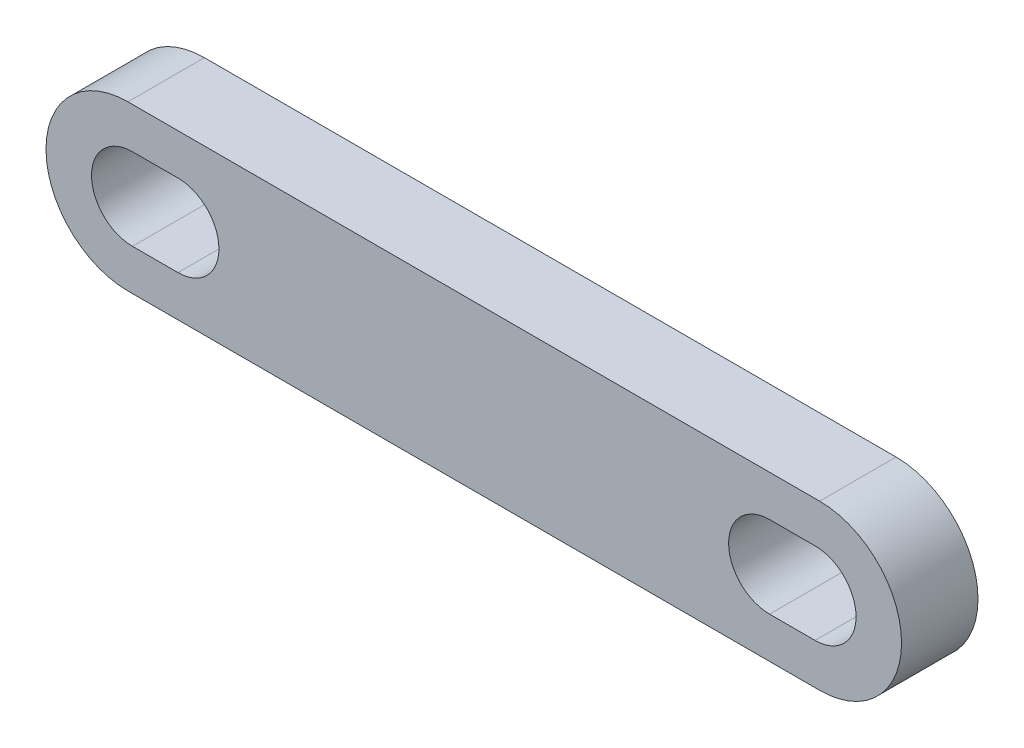
ISO-10303-21;
HEADER;
FILE_DESCRIPTION(('STEP AP214'),'2;1');
FILE_NAME('part.step','',(''),(''),'','','');
FILE_SCHEMA(('AUTOMOTIVE_DESIGN { 1 0 10303 214 1 1 1 1 }'));
ENDSEC;
DATA;
#1=APPLICATION_CONTEXT('core data for automotive mechanical design processes');
#2=APPLICATION_PROTOCOL_DEFINITION('international standard','automotive_design',2000,#1);
#3=PRODUCT_CONTEXT('',#1,'mechanical');
#4=PRODUCT('Part','Part','',(#3));
#5=PRODUCT_RELATED_PRODUCT_CATEGORY('part','',(#4));
#6=PRODUCT_DEFINITION_FORMATION('','',#4);
#7=PRODUCT_DEFINITION_CONTEXT('part definition',#1,'design');
#8=PRODUCT_DEFINITION('design','',#6,#7);
#9=PRODUCT_DEFINITION_SHAPE('','',#8);
#10=(LENGTH_UNIT() NAMED_UNIT(*) SI_UNIT(.MILLI.,.METRE.));
#11=(NAMED_UNIT(*) PLANE_ANGLE_UNIT() SI_UNIT($,.RADIAN.));
#12=(NAMED_UNIT(*) SI_UNIT($,.STERADIAN.) SOLID_ANGLE_UNIT());
#13=UNCERTAINTY_MEASURE_WITH_UNIT(LENGTH_MEASURE(1.E-05),#10,'distance_accuracy_value','');
#14=(GEOMETRIC_REPRESENTATION_CONTEXT(3) GLOBAL_UNCERTAINTY_ASSIGNED_CONTEXT((#13)) GLOBAL_UNIT_ASSIGNED_CONTEXT((#10,
#11,#12)) REPRESENTATION_CONTEXT('',''));
#15=CARTESIAN_POINT('',(0.,0.,0.));
#16=DIRECTION('',(0.,0.,1.));
#17=DIRECTION('',(1.,0.,0.));
#18=AXIS2_PLACEMENT_3D('',#15,#16,#17);
#19=CARTESIAN_POINT('',(19.,0.,4.2));
#20=DIRECTION('',(0.,0.,1.));
#21=DIRECTION('',(1.,0.,0.));
#22=AXIS2_PLACEMENT_3D('',#19,#20,#21);
#23=PLANE('',#22);
#24=CARTESIAN_POINT('',(19.,0.,4.2));
#25=DIRECTION('',(0.,0.,1.));
#26=DIRECTION('',(1.,0.,0.));
#27=AXIS2_PLACEMENT_3D('',#24,#25,#26);
#28=CIRCLE('',#27,4.5);
#29=CARTESIAN_POINT('',(19.,-4.5,4.2));
#30=VERTEX_POINT('',#29);
#31=CARTESIAN_POINT('',(19.,4.5,4.2));
#32=VERTEX_POINT('',#31);
#33=EDGE_CURVE('E190',#30,#32,#28,.T.);
#34=ORIENTED_EDGE('',*,*,#33,.T.);
#35=DIRECTION('',(-1.,0.,0.));
#36=VECTOR('',#35,1.);
#37=CARTESIAN_POINT('',(19.,4.5,4.2));
#38=LINE('',#37,#36);
#39=CARTESIAN_POINT('',(-19.,4.5,4.2));
#40=VERTEX_POINT('',#39);
#41=EDGE_CURVE('E193',#32,#40,#38,.T.);
#42=ORIENTED_EDGE('',*,*,#41,.T.);
#43=CARTESIAN_POINT('',(-19.,0.,4.2));
#44=DIRECTION('',(0.,0.,1.));
#45=DIRECTION('',(1.,0.,0.));
#46=AXIS2_PLACEMENT_3D('',#43,#44,#45);
#47=CIRCLE('',#46,4.5);
#48=CARTESIAN_POINT('',(-19.,-4.5,4.2));
#49=VERTEX_POINT('',#48);
#50=EDGE_CURVE('E196',#40,#49,#47,.T.);
#51=ORIENTED_EDGE('',*,*,#50,.T.);
#52=DIRECTION('',(1.,0.,0.));
#53=VECTOR('',#52,1.);
#54=CARTESIAN_POINT('',(-19.,-4.5,4.2));
#55=LINE('',#54,#53);
#56=EDGE_CURVE('E198',#49,#30,#55,.T.);
#57=ORIENTED_EDGE('',*,*,#56,.T.);
#58=EDGE_LOOP('',(#34,#42,#51,#57));
#59=FACE_BOUND('',#58,.T.);
#60=DIRECTION('',(1.,0.,0.));
#61=VECTOR('',#60,1.);
#62=CARTESIAN_POINT('',(16.25,-2.25,4.2));
#63=LINE('',#62,#61);
#64=CARTESIAN_POINT('',(16.25,-2.25,4.2));
#65=VERTEX_POINT('',#64);
#66=CARTESIAN_POINT('',(18.75,-2.25,4.2));
#67=VERTEX_POINT('',#66);
#68=EDGE_CURVE('E161',#65,#67,#63,.T.);
#69=ORIENTED_EDGE('',*,*,#68,.F.);
#70=CARTESIAN_POINT('',(16.25,0.,4.2));
#71=DIRECTION('',(0.,0.,1.));
#72=DIRECTION('',(1.,0.,0.));
#73=AXIS2_PLACEMENT_3D('',#70,#71,#72);
#74=CIRCLE('',#73,2.25);
#75=CARTESIAN_POINT('',(16.25,2.25,4.2));
#76=VERTEX_POINT('',#75);
#77=EDGE_CURVE('E159',#76,#65,#74,.T.);
#78=ORIENTED_EDGE('',*,*,#77,.F.);
#79=DIRECTION('',(-1.,0.,0.));
#80=VECTOR('',#79,1.);
#81=CARTESIAN_POINT('',(18.75,2.25,4.2));
#82=LINE('',#81,#80);
#83=CARTESIAN_POINT('',(18.75,2.25,4.2));
#84=VERTEX_POINT('',#83);
#85=EDGE_CURVE('E167',#84,#76,#82,.T.);
#86=ORIENTED_EDGE('',*,*,#85,.F.);
#87=CARTESIAN_POINT('',(18.75,0.,4.2));
#88=DIRECTION('',(0.,0.,1.));
#89=DIRECTION('',(1.,0.,0.));
#90=AXIS2_PLACEMENT_3D('',#87,#88,#89);
#91=CIRCLE('',#90,2.25);
#92=EDGE_CURVE('E164',#67,#84,#91,.T.);
#93=ORIENTED_EDGE('',*,*,#92,.F.);
#94=EDGE_LOOP('',(#69,#78,#86,#93));
#95=FACE_BOUND('',#94,.T.);
#96=DIRECTION('',(1.,0.,0.));
#97=VECTOR('',#96,1.);
#98=CARTESIAN_POINT('',(-18.75,-2.25,4.2));
#99=LINE('',#98,#97);
#100=CARTESIAN_POINT('',(-18.75,-2.25,4.2));
#101=VERTEX_POINT('',#100);
#102=CARTESIAN_POINT('',(-16.25,-2.25,4.2));
#103=VERTEX_POINT('',#102);
#104=EDGE_CURVE('E131',#101,#103,#99,.T.);
#105=ORIENTED_EDGE('',*,*,#104,.F.);
#106=CARTESIAN_POINT('',(-18.75,0.,4.2));
#107=DIRECTION('',(0.,0.,1.));
#108=DIRECTION('',(1.,0.,0.));
#109=AXIS2_PLACEMENT_3D('',#106,#107,#108);
#110=CIRCLE('',#109,2.25);
#111=CARTESIAN_POINT('',(-18.75,2.25,4.2));
#112=VERTEX_POINT('',#111);
#113=EDGE_CURVE('E123',#112,#101,#110,.T.);
#114=ORIENTED_EDGE('',*,*,#113,.F.);
#115=DIRECTION('',(-1.,0.,0.));
#116=VECTOR('',#115,1.);
#117=CARTESIAN_POINT('',(-16.25,2.25,4.2));
#118=LINE('',#117,#116);
#119=CARTESIAN_POINT('',(-16.25,2.25,4.2));
#120=VERTEX_POINT('',#119);
#121=EDGE_CURVE('E145',#120,#112,#118,.T.);
#122=ORIENTED_EDGE('',*,*,#121,.F.);
#123=CARTESIAN_POINT('',(-16.25,0.,4.2));
#124=DIRECTION('',(0.,0.,1.));
#125=DIRECTION('',(1.,0.,0.));
#126=AXIS2_PLACEMENT_3D('',#123,#124,#125);
#127=CIRCLE('',#126,2.25);
#128=EDGE_CURVE('E143',#103,#120,#127,.T.);
#129=ORIENTED_EDGE('',*,*,#128,.F.);
#130=EDGE_LOOP('',(#105,#114,#122,#129));
#131=FACE_BOUND('',#130,.T.);
#132=ADVANCED_FACE('F34',(#59,#95,#131),#23,.T.);
#133=CARTESIAN_POINT('',(19.,0.,0.));
#134=DIRECTION('',(0.,0.,1.));
#135=DIRECTION('',(1.,0.,0.));
#136=AXIS2_PLACEMENT_3D('',#133,#134,#135);
#137=PLANE('',#136);
#138=CARTESIAN_POINT('',(16.25,0.,0.));
#139=DIRECTION('',(0.,0.,1.));
#140=DIRECTION('',(1.,0.,0.));
#141=AXIS2_PLACEMENT_3D('',#138,#139,#140);
#142=CIRCLE('',#141,2.25);
#143=CARTESIAN_POINT('',(16.25,2.25,0.));
#144=VERTEX_POINT('',#143);
#145=CARTESIAN_POINT('',(16.25,-2.25,0.));
#146=VERTEX_POINT('',#145);
#147=EDGE_CURVE('E139',#144,#146,#142,.T.);
#148=ORIENTED_EDGE('',*,*,#147,.T.);
#149=DIRECTION('',(1.,0.,0.));
#150=VECTOR('',#149,1.);
#151=CARTESIAN_POINT('',(16.25,-2.25,0.));
#152=LINE('',#151,#150);
#153=CARTESIAN_POINT('',(18.75,-2.25,0.));
#154=VERTEX_POINT('',#153);
#155=EDGE_CURVE('E172',#146,#154,#152,.T.);
#156=ORIENTED_EDGE('',*,*,#155,.T.);
#157=CARTESIAN_POINT('',(18.75,0.,0.));
#158=DIRECTION('',(0.,0.,1.));
#159=DIRECTION('',(1.,0.,0.));
#160=AXIS2_PLACEMENT_3D('',#157,#158,#159);
#161=CIRCLE('',#160,2.25);
#162=CARTESIAN_POINT('',(18.75,2.25,0.));
#163=VERTEX_POINT('',#162);
#164=EDGE_CURVE('E175',#154,#163,#161,.T.);
#165=ORIENTED_EDGE('',*,*,#164,.T.);
#166=DIRECTION('',(-1.,0.,0.));
#167=VECTOR('',#166,1.);
#168=CARTESIAN_POINT('',(18.75,2.25,0.));
#169=LINE('',#168,#167);
#170=EDGE_CURVE('E162',#163,#144,#169,.T.);
#171=ORIENTED_EDGE('',*,*,#170,.T.);
#172=EDGE_LOOP('',(#148,#156,#165,#171));
#173=FACE_BOUND('',#172,.T.);
#174=CARTESIAN_POINT('',(19.,0.,0.));
#175=DIRECTION('',(0.,0.,1.));
#176=DIRECTION('',(1.,0.,0.));
#177=AXIS2_PLACEMENT_3D('',#174,#175,#176);
#178=CIRCLE('',#177,4.5);
#179=CARTESIAN_POINT('',(19.,-4.5,0.));
#180=VERTEX_POINT('',#179);
#181=CARTESIAN_POINT('',(19.,4.5,0.));
#182=VERTEX_POINT('',#181);
#183=EDGE_CURVE('E189',#180,#182,#178,.T.);
#184=ORIENTED_EDGE('',*,*,#183,.F.);
#185=DIRECTION('',(1.,0.,0.));
#186=VECTOR('',#185,1.);
#187=CARTESIAN_POINT('',(-19.,-4.5,0.));
#188=LINE('',#187,#186);
#189=CARTESIAN_POINT('',(-19.,-4.5,0.));
#190=VERTEX_POINT('',#189);
#191=EDGE_CURVE('E194',#190,#180,#188,.T.);
#192=ORIENTED_EDGE('',*,*,#191,.F.);
#193=CARTESIAN_POINT('',(-19.,0.,0.));
#194=DIRECTION('',(0.,0.,1.));
#195=DIRECTION('',(1.,0.,0.));
#196=AXIS2_PLACEMENT_3D('',#193,#194,#195);
#197=CIRCLE('',#196,4.5);
#198=CARTESIAN_POINT('',(-19.,4.5,0.));
#199=VERTEX_POINT('',#198);
#200=EDGE_CURVE('E205',#199,#190,#197,.T.);
#201=ORIENTED_EDGE('',*,*,#200,.F.);
#202=DIRECTION('',(-1.,0.,0.));
#203=VECTOR('',#202,1.);
#204=CARTESIAN_POINT('',(19.,4.5,0.));
#205=LINE('',#204,#203);
#206=EDGE_CURVE('E203',#182,#199,#205,.T.);
#207=ORIENTED_EDGE('',*,*,#206,.F.);
#208=EDGE_LOOP('',(#184,#192,#201,#207));
#209=FACE_BOUND('',#208,.T.);
#210=CARTESIAN_POINT('',(-18.75,0.,0.));
#211=DIRECTION('',(0.,0.,1.));
#212=DIRECTION('',(1.,0.,0.));
#213=AXIS2_PLACEMENT_3D('',#210,#211,#212);
#214=CIRCLE('',#213,2.25);
#215=CARTESIAN_POINT('',(-18.75,2.25,0.));
#216=VERTEX_POINT('',#215);
#217=CARTESIAN_POINT('',(-18.75,-2.25,0.));
#218=VERTEX_POINT('',#217);
#219=EDGE_CURVE('E57',#216,#218,#214,.T.);
#220=ORIENTED_EDGE('',*,*,#219,.T.);
#221=DIRECTION('',(1.,0.,0.));
#222=VECTOR('',#221,1.);
#223=CARTESIAN_POINT('',(-18.75,-2.25,0.));
#224=LINE('',#223,#222);
#225=CARTESIAN_POINT('',(-16.25,-2.25,0.));
#226=VERTEX_POINT('',#225);
#227=EDGE_CURVE('E138',#218,#226,#224,.T.);
#228=ORIENTED_EDGE('',*,*,#227,.T.);
#229=CARTESIAN_POINT('',(-16.25,0.,0.));
#230=DIRECTION('',(0.,0.,1.));
#231=DIRECTION('',(1.,0.,0.));
#232=AXIS2_PLACEMENT_3D('',#229,#230,#231);
#233=CIRCLE('',#232,2.25);
#234=CARTESIAN_POINT('',(-16.25,2.25,0.));
#235=VERTEX_POINT('',#234);
#236=EDGE_CURVE('E151',#226,#235,#233,.T.);
#237=ORIENTED_EDGE('',*,*,#236,.T.);
#238=DIRECTION('',(-1.,0.,0.));
#239=VECTOR('',#238,1.);
#240=CARTESIAN_POINT('',(-16.25,2.25,0.));
#241=LINE('',#240,#239);
#242=EDGE_CURVE('E132',#235,#216,#241,.T.);
#243=ORIENTED_EDGE('',*,*,#242,.T.);
#244=EDGE_LOOP('',(#220,#228,#237,#243));
#245=FACE_BOUND('',#244,.T.);
#246=ADVANCED_FACE('F223',(#173,#209,#245),#137,.F.);
#247=CARTESIAN_POINT('',(19.,0.,4.2));
#248=DIRECTION('',(0.,0.,-1.));
#249=DIRECTION('',(-1.,0.,0.));
#250=AXIS2_PLACEMENT_3D('',#247,#248,#249);
#251=CYLINDRICAL_SURFACE('',#250,4.5);
#252=ORIENTED_EDGE('',*,*,#183,.T.);
#253=DIRECTION('',(0.,0.,-1.));
#254=VECTOR('',#253,1.);
#255=CARTESIAN_POINT('',(19.,4.5,4.2));
#256=LINE('',#255,#254);
#257=EDGE_CURVE('E11',#32,#182,#256,.T.);
#258=ORIENTED_EDGE('',*,*,#257,.F.);
#259=ORIENTED_EDGE('',*,*,#33,.F.);
#260=DIRECTION('',(0.,0.,-1.));
#261=VECTOR('',#260,1.);
#262=CARTESIAN_POINT('',(19.,-4.5,4.2));
#263=LINE('',#262,#261);
#264=EDGE_CURVE('E200',#30,#180,#263,.T.);
#265=ORIENTED_EDGE('',*,*,#264,.T.);
#266=EDGE_LOOP('',(#252,#258,#259,#265));
#267=FACE_BOUND('',#266,.T.);
#268=ADVANCED_FACE('F36',(#267),#251,.T.);
#269=CARTESIAN_POINT('',(19.,4.5,4.2));
#270=DIRECTION('',(0.,-1.,0.));
#271=DIRECTION('',(1.,0.,0.));
#272=AXIS2_PLACEMENT_3D('',#269,#270,#271);
#273=PLANE('',#272);
#274=ORIENTED_EDGE('',*,*,#206,.T.);
#275=DIRECTION('',(0.,0.,-1.));
#276=VECTOR('',#275,1.);
#277=CARTESIAN_POINT('',(-19.,4.5,4.2));
#278=LINE('',#277,#276);
#279=EDGE_CURVE('E42',#40,#199,#278,.T.);
#280=ORIENTED_EDGE('',*,*,#279,.F.);
#281=ORIENTED_EDGE('',*,*,#41,.F.);
#282=ORIENTED_EDGE('',*,*,#257,.T.);
#283=EDGE_LOOP('',(#274,#280,#281,#282));
#284=FACE_BOUND('',#283,.T.);
#285=ADVANCED_FACE('F234',(#284),#273,.F.);
#286=CARTESIAN_POINT('',(-19.,0.,4.2));
#287=DIRECTION('',(0.,0.,-1.));
#288=DIRECTION('',(-1.,0.,0.));
#289=AXIS2_PLACEMENT_3D('',#286,#287,#288);
#290=CYLINDRICAL_SURFACE('',#289,4.5);
#291=ORIENTED_EDGE('',*,*,#200,.T.);
#292=DIRECTION('',(0.,0.,-1.));
#293=VECTOR('',#292,1.);
#294=CARTESIAN_POINT('',(-19.,-4.5,4.2));
#295=LINE('',#294,#293);
#296=EDGE_CURVE('E210',#49,#190,#295,.T.);
#297=ORIENTED_EDGE('',*,*,#296,.F.);
#298=ORIENTED_EDGE('',*,*,#50,.F.);
#299=ORIENTED_EDGE('',*,*,#279,.T.);
#300=EDGE_LOOP('',(#291,#297,#298,#299));
#301=FACE_BOUND('',#300,.T.);
#302=ADVANCED_FACE('F217',(#301),#290,.T.);
#303=CARTESIAN_POINT('',(-19.,-4.5,4.2));
#304=DIRECTION('',(0.,1.,0.));
#305=DIRECTION('',(-1.,0.,0.));
#306=AXIS2_PLACEMENT_3D('',#303,#304,#305);
#307=PLANE('',#306);
#308=ORIENTED_EDGE('',*,*,#191,.T.);
#309=ORIENTED_EDGE('',*,*,#264,.F.);
#310=ORIENTED_EDGE('',*,*,#56,.F.);
#311=ORIENTED_EDGE('',*,*,#296,.T.);
#312=EDGE_LOOP('',(#308,#309,#310,#311));
#313=FACE_BOUND('',#312,.T.);
#314=ADVANCED_FACE('F227',(#313),#307,.F.);
#315=CARTESIAN_POINT('',(16.25,0.,4.2));
#316=DIRECTION('',(0.,0.,-1.));
#317=DIRECTION('',(-1.,0.,0.));
#318=AXIS2_PLACEMENT_3D('',#315,#316,#317);
#319=CYLINDRICAL_SURFACE('',#318,2.25);
#320=ORIENTED_EDGE('',*,*,#147,.F.);
#321=DIRECTION('',(0.,0.,-1.));
#322=VECTOR('',#321,1.);
#323=CARTESIAN_POINT('',(16.25,2.25,4.2));
#324=LINE('',#323,#322);
#325=EDGE_CURVE('E169',#76,#144,#324,.T.);
#326=ORIENTED_EDGE('',*,*,#325,.F.);
#327=ORIENTED_EDGE('',*,*,#77,.T.);
#328=DIRECTION('',(0.,0.,-1.));
#329=VECTOR('',#328,1.);
#330=CARTESIAN_POINT('',(16.25,-2.25,4.2));
#331=LINE('',#330,#329);
#332=EDGE_CURVE('E186',#65,#146,#331,.T.);
#333=ORIENTED_EDGE('',*,*,#332,.T.);
#334=EDGE_LOOP('',(#320,#326,#327,#333));
#335=FACE_BOUND('',#334,.T.);
#336=ADVANCED_FACE('F249',(#335),#319,.F.);
#337=CARTESIAN_POINT('',(16.25,-2.25,4.2));
#338=DIRECTION('',(0.,1.,0.));
#339=DIRECTION('',(0.,0.,1.));
#340=AXIS2_PLACEMENT_3D('',#337,#338,#339);
#341=PLANE('',#340);
#342=ORIENTED_EDGE('',*,*,#155,.F.);
#343=ORIENTED_EDGE('',*,*,#332,.F.);
#344=ORIENTED_EDGE('',*,*,#68,.T.);
#345=DIRECTION('',(0.,0.,-1.));
#346=VECTOR('',#345,1.);
#347=CARTESIAN_POINT('',(18.75,-2.25,4.2));
#348=LINE('',#347,#346);
#349=EDGE_CURVE('E184',#67,#154,#348,.T.);
#350=ORIENTED_EDGE('',*,*,#349,.T.);
#351=EDGE_LOOP('',(#342,#343,#344,#350));
#352=FACE_BOUND('',#351,.T.);
#353=ADVANCED_FACE('F256',(#352),#341,.T.);
#354=CARTESIAN_POINT('',(18.75,0.,4.2));
#355=DIRECTION('',(0.,0.,-1.));
#356=DIRECTION('',(-1.,0.,0.));
#357=AXIS2_PLACEMENT_3D('',#354,#355,#356);
#358=CYLINDRICAL_SURFACE('',#357,2.25);
#359=ORIENTED_EDGE('',*,*,#164,.F.);
#360=ORIENTED_EDGE('',*,*,#349,.F.);
#361=ORIENTED_EDGE('',*,*,#92,.T.);
#362=DIRECTION('',(0.,0.,-1.));
#363=VECTOR('',#362,1.);
#364=CARTESIAN_POINT('',(18.75,2.25,4.2));
#365=LINE('',#364,#363);
#366=EDGE_CURVE('E182',#84,#163,#365,.T.);
#367=ORIENTED_EDGE('',*,*,#366,.T.);
#368=EDGE_LOOP('',(#359,#360,#361,#367));
#369=FACE_BOUND('',#368,.T.);
#370=ADVANCED_FACE('F261',(#369),#358,.F.);
#371=CARTESIAN_POINT('',(18.75,2.25,4.2));
#372=DIRECTION('',(0.,-1.,0.));
#373=DIRECTION('',(1.,0.,0.));
#374=AXIS2_PLACEMENT_3D('',#371,#372,#373);
#375=PLANE('',#374);
#376=ORIENTED_EDGE('',*,*,#170,.F.);
#377=ORIENTED_EDGE('',*,*,#366,.F.);
#378=ORIENTED_EDGE('',*,*,#85,.T.);
#379=ORIENTED_EDGE('',*,*,#325,.T.);
#380=EDGE_LOOP('',(#376,#377,#378,#379));
#381=FACE_BOUND('',#380,.T.);
#382=ADVANCED_FACE('F268',(#381),#375,.T.);
#383=CARTESIAN_POINT('',(-18.75,0.,4.2));
#384=DIRECTION('',(0.,0.,-1.));
#385=DIRECTION('',(-1.,0.,0.));
#386=AXIS2_PLACEMENT_3D('',#383,#384,#385);
#387=CYLINDRICAL_SURFACE('',#386,2.25);
#388=ORIENTED_EDGE('',*,*,#219,.F.);
#389=DIRECTION('',(0.,0.,-1.));
#390=VECTOR('',#389,1.);
#391=CARTESIAN_POINT('',(-18.75,2.25,4.2));
#392=LINE('',#391,#390);
#393=EDGE_CURVE('E127',#112,#216,#392,.T.);
#394=ORIENTED_EDGE('',*,*,#393,.F.);
#395=ORIENTED_EDGE('',*,*,#113,.T.);
#396=DIRECTION('',(0.,0.,-1.));
#397=VECTOR('',#396,1.);
#398=CARTESIAN_POINT('',(-18.75,-2.25,4.2));
#399=LINE('',#398,#397);
#400=EDGE_CURVE('E126',#101,#218,#399,.T.);
#401=ORIENTED_EDGE('',*,*,#400,.T.);
#402=EDGE_LOOP('',(#388,#394,#395,#401));
#403=FACE_BOUND('',#402,.T.);
#404=ADVANCED_FACE('F125',(#403),#387,.F.);
#405=CARTESIAN_POINT('',(-18.75,-2.25,4.2));
#406=DIRECTION('',(0.,1.,0.));
#407=DIRECTION('',(0.,0.,1.));
#408=AXIS2_PLACEMENT_3D('',#405,#406,#407);
#409=PLANE('',#408);
#410=ORIENTED_EDGE('',*,*,#227,.F.);
#411=ORIENTED_EDGE('',*,*,#400,.F.);
#412=ORIENTED_EDGE('',*,*,#104,.T.);
#413=DIRECTION('',(0.,0.,-1.));
#414=VECTOR('',#413,1.);
#415=CARTESIAN_POINT('',(-16.25,-2.25,4.2));
#416=LINE('',#415,#414);
#417=EDGE_CURVE('E140',#103,#226,#416,.T.);
#418=ORIENTED_EDGE('',*,*,#417,.T.);
#419=EDGE_LOOP('',(#410,#411,#412,#418));
#420=FACE_BOUND('',#419,.T.);
#421=ADVANCED_FACE('F135',(#420),#409,.T.);
#422=CARTESIAN_POINT('',(-16.25,0.,4.2));
#423=DIRECTION('',(0.,0.,-1.));
#424=DIRECTION('',(-1.,0.,0.));
#425=AXIS2_PLACEMENT_3D('',#422,#423,#424);
#426=CYLINDRICAL_SURFACE('',#425,2.25);
#427=ORIENTED_EDGE('',*,*,#236,.F.);
#428=ORIENTED_EDGE('',*,*,#417,.F.);
#429=ORIENTED_EDGE('',*,*,#128,.T.);
#430=DIRECTION('',(0.,0.,-1.));
#431=VECTOR('',#430,1.);
#432=CARTESIAN_POINT('',(-16.25,2.25,4.2));
#433=LINE('',#432,#431);
#434=EDGE_CURVE('E49',#120,#235,#433,.T.);
#435=ORIENTED_EDGE('',*,*,#434,.T.);
#436=EDGE_LOOP('',(#427,#428,#429,#435));
#437=FACE_BOUND('',#436,.T.);
#438=ADVANCED_FACE('F286',(#437),#426,.F.);
#439=CARTESIAN_POINT('',(-16.25,2.25,4.2));
#440=DIRECTION('',(0.,-1.,0.));
#441=DIRECTION('',(1.,0.,0.));
#442=AXIS2_PLACEMENT_3D('',#439,#440,#441);
#443=PLANE('',#442);
#444=ORIENTED_EDGE('',*,*,#242,.F.);
#445=ORIENTED_EDGE('',*,*,#434,.F.);
#446=ORIENTED_EDGE('',*,*,#121,.T.);
#447=ORIENTED_EDGE('',*,*,#393,.T.);
#448=EDGE_LOOP('',(#444,#445,#446,#447));
#449=FACE_BOUND('',#448,.T.);
#450=ADVANCED_FACE('F289',(#449),#443,.T.);
#451=CLOSED_SHELL('',(#132,#246,#268,#285,#302,#314,#336,#353,#370,#382,#404,#421,#438,#450));
#452=MANIFOLD_SOLID_BREP('B2',#451);
#453=ADVANCED_BREP_SHAPE_REPRESENTATION('',(#18,#452),#14);
#454=SHAPE_DEFINITION_REPRESENTATION(#9,#453);
ENDSEC;
END-ISO-10303-21;
